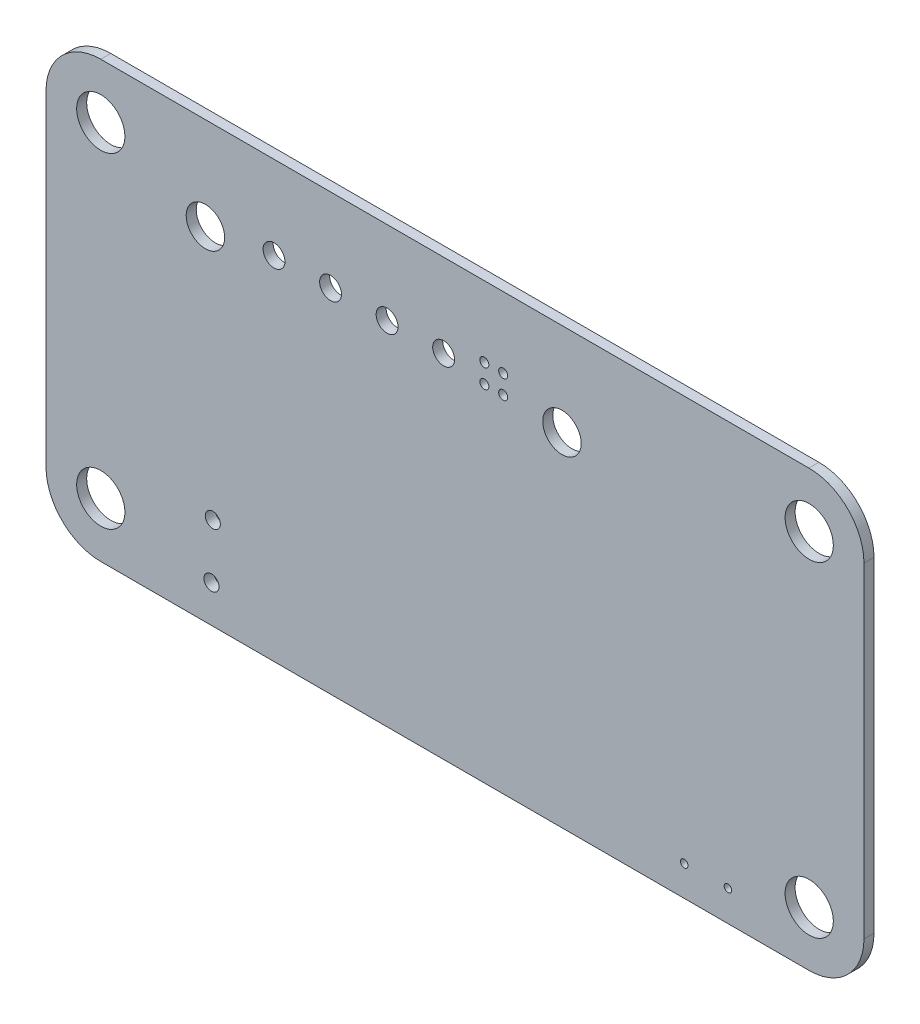
ISO-10303-21;
HEADER;
FILE_DESCRIPTION(('STEP AP214'),'2;1');
FILE_NAME('part.step','',(''),(''),'','','');
FILE_SCHEMA(('AUTOMOTIVE_DESIGN { 1 0 10303 214 1 1 1 1 }'));
ENDSEC;
DATA;
#1=APPLICATION_CONTEXT('core data for automotive mechanical design processes');
#2=APPLICATION_PROTOCOL_DEFINITION('international standard','automotive_design',2000,#1);
#3=PRODUCT_CONTEXT('',#1,'mechanical');
#4=PRODUCT('Part','Part','',(#3));
#5=PRODUCT_RELATED_PRODUCT_CATEGORY('part','',(#4));
#6=PRODUCT_DEFINITION_FORMATION('','',#4);
#7=PRODUCT_DEFINITION_CONTEXT('part definition',#1,'design');
#8=PRODUCT_DEFINITION('design','',#6,#7);
#9=PRODUCT_DEFINITION_SHAPE('','',#8);
#10=(LENGTH_UNIT() NAMED_UNIT(*) SI_UNIT(.MILLI.,.METRE.));
#11=(NAMED_UNIT(*) PLANE_ANGLE_UNIT() SI_UNIT($,.RADIAN.));
#12=(NAMED_UNIT(*) SI_UNIT($,.STERADIAN.) SOLID_ANGLE_UNIT());
#13=UNCERTAINTY_MEASURE_WITH_UNIT(LENGTH_MEASURE(1.E-05),#10,'distance_accuracy_value','');
#14=(GEOMETRIC_REPRESENTATION_CONTEXT(3) GLOBAL_UNCERTAINTY_ASSIGNED_CONTEXT((#13)) GLOBAL_UNIT_ASSIGNED_CONTEXT((#10,
#11,#12)) REPRESENTATION_CONTEXT('',''));
#15=CARTESIAN_POINT('',(0.,0.,0.));
#16=DIRECTION('',(0.,0.,1.));
#17=DIRECTION('',(1.,0.,0.));
#18=AXIS2_PLACEMENT_3D('',#15,#16,#17);
#19=CARTESIAN_POINT('',(180.808877,-103.632,-0.0262));
#20=DIRECTION('',(0.,0.,-1.));
#21=DIRECTION('',(0.,-1.,0.));
#22=AXIS2_PLACEMENT_3D('',#19,#20,#21);
#23=CYLINDRICAL_SURFACE('',#22,1.6);
#24=CARTESIAN_POINT('',(180.808877,-103.632,0.));
#25=DIRECTION('',(0.,0.,-1.));
#26=DIRECTION('',(0.,-1.,0.));
#27=AXIS2_PLACEMENT_3D('',#24,#25,#26);
#28=CIRCLE('',#27,1.6);
#29=CARTESIAN_POINT('',(180.808877,-105.232,0.));
#30=VERTEX_POINT('',#29);
#31=EDGE_CURVE('E293',#30,#30,#28,.T.);
#32=ORIENTED_EDGE('',*,*,#31,.T.);
#33=DIRECTION('',(0.,0.,1.));
#34=VECTOR('',#33,1.);
#35=CARTESIAN_POINT('',(180.808877,-105.232,-0.0262));
#36=LINE('',#35,#34);
#37=CARTESIAN_POINT('',(180.808877,-105.232,0.665));
#38=VERTEX_POINT('',#37);
#39=EDGE_CURVE('E9',#30,#38,#36,.T.);
#40=ORIENTED_EDGE('',*,*,#39,.T.);
#41=CARTESIAN_POINT('',(180.808877,-103.632,0.665));
#42=DIRECTION('',(0.,0.,-1.));
#43=DIRECTION('',(0.,-1.,0.));
#44=AXIS2_PLACEMENT_3D('',#41,#42,#43);
#45=CIRCLE('',#44,1.6);
#46=EDGE_CURVE('E257',#38,#38,#45,.T.);
#47=ORIENTED_EDGE('',*,*,#46,.F.);
#48=ORIENTED_EDGE('',*,*,#39,.F.);
#49=EDGE_LOOP('',(#32,#40,#47,#48));
#50=FACE_BOUND('',#49,.T.);
#51=ADVANCED_FACE('F15',(#50),#23,.F.);
#52=CARTESIAN_POINT('',(160.51,-104.69,-0.0262));
#53=DIRECTION('',(0.,0.,-1.));
#54=DIRECTION('',(0.,-1.,0.));
#55=AXIS2_PLACEMENT_3D('',#52,#53,#54);
#56=CYLINDRICAL_SURFACE('',#55,0.3);
#57=CARTESIAN_POINT('',(160.51,-104.69,0.));
#58=DIRECTION('',(0.,0.,-1.));
#59=DIRECTION('',(0.,-1.,0.));
#60=AXIS2_PLACEMENT_3D('',#57,#58,#59);
#61=CIRCLE('',#60,0.3);
#62=CARTESIAN_POINT('',(160.51,-104.99,0.));
#63=VERTEX_POINT('',#62);
#64=EDGE_CURVE('E290',#63,#63,#61,.T.);
#65=ORIENTED_EDGE('',*,*,#64,.T.);
#66=DIRECTION('',(0.,0.,1.));
#67=VECTOR('',#66,1.);
#68=CARTESIAN_POINT('',(160.51,-104.99,-0.0262));
#69=LINE('',#68,#67);
#70=CARTESIAN_POINT('',(160.51,-104.99,0.665));
#71=VERTEX_POINT('',#70);
#72=EDGE_CURVE('E23',#63,#71,#69,.T.);
#73=ORIENTED_EDGE('',*,*,#72,.T.);
#74=CARTESIAN_POINT('',(160.51,-104.69,0.665));
#75=DIRECTION('',(0.,0.,-1.));
#76=DIRECTION('',(0.,-1.,0.));
#77=AXIS2_PLACEMENT_3D('',#74,#75,#76);
#78=CIRCLE('',#77,0.3);
#79=EDGE_CURVE('E430',#71,#71,#78,.T.);
#80=ORIENTED_EDGE('',*,*,#79,.F.);
#81=ORIENTED_EDGE('',*,*,#72,.F.);
#82=EDGE_LOOP('',(#65,#73,#80,#81));
#83=FACE_BOUND('',#82,.T.);
#84=ADVANCED_FACE('F825',(#83),#56,.F.);
#85=CARTESIAN_POINT('',(159.26,-104.69,-0.0262));
#86=DIRECTION('',(0.,0.,-1.));
#87=DIRECTION('',(0.,-1.,0.));
#88=AXIS2_PLACEMENT_3D('',#85,#86,#87);
#89=CYLINDRICAL_SURFACE('',#88,0.3);
#90=CARTESIAN_POINT('',(159.26,-104.69,0.));
#91=DIRECTION('',(0.,0.,-1.));
#92=DIRECTION('',(0.,-1.,0.));
#93=AXIS2_PLACEMENT_3D('',#90,#91,#92);
#94=CIRCLE('',#93,0.3);
#95=CARTESIAN_POINT('',(159.26,-104.99,0.));
#96=VERTEX_POINT('',#95);
#97=EDGE_CURVE('E294',#96,#96,#94,.T.);
#98=ORIENTED_EDGE('',*,*,#97,.T.);
#99=DIRECTION('',(0.,0.,1.));
#100=VECTOR('',#99,1.);
#101=CARTESIAN_POINT('',(159.26,-104.99,-0.0262));
#102=LINE('',#101,#100);
#103=CARTESIAN_POINT('',(159.26,-104.99,0.665));
#104=VERTEX_POINT('',#103);
#105=EDGE_CURVE('E470',#96,#104,#102,.T.);
#106=ORIENTED_EDGE('',*,*,#105,.T.);
#107=CARTESIAN_POINT('',(159.26,-104.69,0.665));
#108=DIRECTION('',(0.,0.,-1.));
#109=DIRECTION('',(0.,-1.,0.));
#110=AXIS2_PLACEMENT_3D('',#107,#108,#109);
#111=CIRCLE('',#110,0.3);
#112=EDGE_CURVE('E413',#104,#104,#111,.T.);
#113=ORIENTED_EDGE('',*,*,#112,.F.);
#114=ORIENTED_EDGE('',*,*,#105,.F.);
#115=EDGE_LOOP('',(#98,#106,#113,#114));
#116=FACE_BOUND('',#115,.T.);
#117=ADVANCED_FACE('F829',(#116),#89,.F.);
#118=CARTESIAN_POINT('',(164.41,-106.14,-0.0262));
#119=DIRECTION('',(0.,0.,-1.));
#120=DIRECTION('',(0.,-1.,0.));
#121=AXIS2_PLACEMENT_3D('',#118,#119,#120);
#122=CYLINDRICAL_SURFACE('',#121,1.275);
#123=CARTESIAN_POINT('',(164.41,-106.14,0.));
#124=DIRECTION('',(0.,0.,-1.));
#125=DIRECTION('',(0.,-1.,0.));
#126=AXIS2_PLACEMENT_3D('',#123,#124,#125);
#127=CIRCLE('',#126,1.275);
#128=CARTESIAN_POINT('',(164.41,-107.415,0.));
#129=VERTEX_POINT('',#128);
#130=EDGE_CURVE('E343',#129,#129,#127,.T.);
#131=ORIENTED_EDGE('',*,*,#130,.T.);
#132=DIRECTION('',(0.,0.,1.));
#133=VECTOR('',#132,1.);
#134=CARTESIAN_POINT('',(164.41,-107.415,-0.0262));
#135=LINE('',#134,#133);
#136=CARTESIAN_POINT('',(164.41,-107.415,0.665));
#137=VERTEX_POINT('',#136);
#138=EDGE_CURVE('E467',#129,#137,#135,.T.);
#139=ORIENTED_EDGE('',*,*,#138,.T.);
#140=CARTESIAN_POINT('',(164.41,-106.14,0.665));
#141=DIRECTION('',(0.,0.,-1.));
#142=DIRECTION('',(0.,-1.,0.));
#143=AXIS2_PLACEMENT_3D('',#140,#141,#142);
#144=CIRCLE('',#143,1.275);
#145=EDGE_CURVE('E409',#137,#137,#144,.T.);
#146=ORIENTED_EDGE('',*,*,#145,.F.);
#147=ORIENTED_EDGE('',*,*,#138,.F.);
#148=EDGE_LOOP('',(#131,#139,#146,#147));
#149=FACE_BOUND('',#148,.T.);
#150=ADVANCED_FACE('F1100',(#149),#122,.F.);
#151=CARTESIAN_POINT('',(160.51,-105.94,-0.0262));
#152=DIRECTION('',(0.,0.,-1.));
#153=DIRECTION('',(0.,-1.,0.));
#154=AXIS2_PLACEMENT_3D('',#151,#152,#153);
#155=CYLINDRICAL_SURFACE('',#154,0.3);
#156=CARTESIAN_POINT('',(160.51,-105.94,0.));
#157=DIRECTION('',(0.,0.,-1.));
#158=DIRECTION('',(0.,-1.,0.));
#159=AXIS2_PLACEMENT_3D('',#156,#157,#158);
#160=CIRCLE('',#159,0.3);
#161=CARTESIAN_POINT('',(160.51,-106.24,0.));
#162=VERTEX_POINT('',#161);
#163=EDGE_CURVE('E339',#162,#162,#160,.T.);
#164=ORIENTED_EDGE('',*,*,#163,.T.);
#165=DIRECTION('',(0.,0.,1.));
#166=VECTOR('',#165,1.);
#167=CARTESIAN_POINT('',(160.51,-106.24,-0.0262));
#168=LINE('',#167,#166);
#169=CARTESIAN_POINT('',(160.51,-106.24,0.665));
#170=VERTEX_POINT('',#169);
#171=EDGE_CURVE('E471',#162,#170,#168,.T.);
#172=ORIENTED_EDGE('',*,*,#171,.T.);
#173=CARTESIAN_POINT('',(160.51,-105.94,0.665));
#174=DIRECTION('',(0.,0.,-1.));
#175=DIRECTION('',(0.,-1.,0.));
#176=AXIS2_PLACEMENT_3D('',#173,#174,#175);
#177=CIRCLE('',#176,0.3);
#178=EDGE_CURVE('E414',#170,#170,#177,.T.);
#179=ORIENTED_EDGE('',*,*,#178,.F.);
#180=ORIENTED_EDGE('',*,*,#171,.F.);
#181=EDGE_LOOP('',(#164,#172,#179,#180));
#182=FACE_BOUND('',#181,.T.);
#183=ADVANCED_FACE('F1089',(#182),#155,.F.);
#184=CARTESIAN_POINT('',(159.26,-105.94,-0.0262));
#185=DIRECTION('',(0.,0.,-1.));
#186=DIRECTION('',(0.,-1.,0.));
#187=AXIS2_PLACEMENT_3D('',#184,#185,#186);
#188=CYLINDRICAL_SURFACE('',#187,0.3);
#189=CARTESIAN_POINT('',(159.26,-105.94,0.));
#190=DIRECTION('',(0.,0.,-1.));
#191=DIRECTION('',(0.,-1.,0.));
#192=AXIS2_PLACEMENT_3D('',#189,#190,#191);
#193=CIRCLE('',#192,0.3);
#194=CARTESIAN_POINT('',(159.26,-106.24,0.));
#195=VERTEX_POINT('',#194);
#196=EDGE_CURVE('E344',#195,#195,#193,.T.);
#197=ORIENTED_EDGE('',*,*,#196,.T.);
#198=DIRECTION('',(0.,0.,1.));
#199=VECTOR('',#198,1.);
#200=CARTESIAN_POINT('',(159.26,-106.24,-0.0262));
#201=LINE('',#200,#199);
#202=CARTESIAN_POINT('',(159.26,-106.24,0.665));
#203=VERTEX_POINT('',#202);
#204=EDGE_CURVE('E448',#195,#203,#201,.T.);
#205=ORIENTED_EDGE('',*,*,#204,.T.);
#206=CARTESIAN_POINT('',(159.26,-105.94,0.665));
#207=DIRECTION('',(0.,0.,-1.));
#208=DIRECTION('',(0.,-1.,0.));
#209=AXIS2_PLACEMENT_3D('',#206,#207,#208);
#210=CIRCLE('',#209,0.3);
#211=EDGE_CURVE('E329',#203,#203,#210,.T.);
#212=ORIENTED_EDGE('',*,*,#211,.F.);
#213=ORIENTED_EDGE('',*,*,#204,.F.);
#214=EDGE_LOOP('',(#197,#205,#212,#213));
#215=FACE_BOUND('',#214,.T.);
#216=ADVANCED_FACE('F1078',(#215),#188,.F.);
#217=CARTESIAN_POINT('',(156.56,-105.52,-0.0262));
#218=DIRECTION('',(0.,0.,-1.));
#219=DIRECTION('',(0.,-1.,0.));
#220=AXIS2_PLACEMENT_3D('',#217,#218,#219);
#221=CYLINDRICAL_SURFACE('',#220,0.725);
#222=CARTESIAN_POINT('',(156.56,-105.52,0.));
#223=DIRECTION('',(0.,0.,-1.));
#224=DIRECTION('',(0.,-1.,0.));
#225=AXIS2_PLACEMENT_3D('',#222,#223,#224);
#226=CIRCLE('',#225,0.725);
#227=CARTESIAN_POINT('',(156.56,-106.245,0.));
#228=VERTEX_POINT('',#227);
#229=EDGE_CURVE('E397',#228,#228,#226,.T.);
#230=ORIENTED_EDGE('',*,*,#229,.T.);
#231=DIRECTION('',(0.,0.,1.));
#232=VECTOR('',#231,1.);
#233=CARTESIAN_POINT('',(156.56,-106.245,-0.0262));
#234=LINE('',#233,#232);
#235=CARTESIAN_POINT('',(156.56,-106.245,0.665));
#236=VERTEX_POINT('',#235);
#237=EDGE_CURVE('E358',#228,#236,#234,.T.);
#238=ORIENTED_EDGE('',*,*,#237,.T.);
#239=CARTESIAN_POINT('',(156.56,-105.52,0.665));
#240=DIRECTION('',(0.,0.,-1.));
#241=DIRECTION('',(0.,-1.,0.));
#242=AXIS2_PLACEMENT_3D('',#239,#240,#241);
#243=CIRCLE('',#242,0.725);
#244=EDGE_CURVE('E325',#236,#236,#243,.T.);
#245=ORIENTED_EDGE('',*,*,#244,.F.);
#246=ORIENTED_EDGE('',*,*,#237,.F.);
#247=EDGE_LOOP('',(#230,#238,#245,#246));
#248=FACE_BOUND('',#247,.T.);
#249=ADVANCED_FACE('F1067',(#248),#221,.F.);
#250=CARTESIAN_POINT('',(152.81,-105.52,-0.0262));
#251=DIRECTION('',(0.,0.,-1.));
#252=DIRECTION('',(0.,-1.,0.));
#253=AXIS2_PLACEMENT_3D('',#250,#251,#252);
#254=CYLINDRICAL_SURFACE('',#253,0.725);
#255=CARTESIAN_POINT('',(152.81,-105.52,0.));
#256=DIRECTION('',(0.,0.,-1.));
#257=DIRECTION('',(0.,-1.,0.));
#258=AXIS2_PLACEMENT_3D('',#255,#256,#257);
#259=CIRCLE('',#258,0.725);
#260=CARTESIAN_POINT('',(152.81,-106.245,0.));
#261=VERTEX_POINT('',#260);
#262=EDGE_CURVE('E393',#261,#261,#259,.T.);
#263=ORIENTED_EDGE('',*,*,#262,.T.);
#264=DIRECTION('',(0.,0.,1.));
#265=VECTOR('',#264,1.);
#266=CARTESIAN_POINT('',(152.81,-106.245,-0.0262));
#267=LINE('',#266,#265);
#268=CARTESIAN_POINT('',(152.81,-106.245,0.665));
#269=VERTEX_POINT('',#268);
#270=EDGE_CURVE('E355',#261,#269,#267,.T.);
#271=ORIENTED_EDGE('',*,*,#270,.T.);
#272=CARTESIAN_POINT('',(152.81,-105.52,0.665));
#273=DIRECTION('',(0.,0.,-1.));
#274=DIRECTION('',(0.,-1.,0.));
#275=AXIS2_PLACEMENT_3D('',#272,#273,#274);
#276=CIRCLE('',#275,0.725);
#277=EDGE_CURVE('E330',#269,#269,#276,.T.);
#278=ORIENTED_EDGE('',*,*,#277,.F.);
#279=ORIENTED_EDGE('',*,*,#270,.F.);
#280=EDGE_LOOP('',(#263,#271,#278,#279));
#281=FACE_BOUND('',#280,.T.);
#282=ADVANCED_FACE('F1056',(#281),#254,.F.);
#283=CARTESIAN_POINT('',(149.06,-105.52,-0.0262));
#284=DIRECTION('',(0.,0.,-1.));
#285=DIRECTION('',(0.,-1.,0.));
#286=AXIS2_PLACEMENT_3D('',#283,#284,#285);
#287=CYLINDRICAL_SURFACE('',#286,0.725);
#288=CARTESIAN_POINT('',(149.06,-105.52,0.));
#289=DIRECTION('',(0.,0.,-1.));
#290=DIRECTION('',(0.,-1.,0.));
#291=AXIS2_PLACEMENT_3D('',#288,#289,#290);
#292=CIRCLE('',#291,0.725);
#293=CARTESIAN_POINT('',(149.06,-106.245,0.));
#294=VERTEX_POINT('',#293);
#295=EDGE_CURVE('E383',#294,#294,#292,.T.);
#296=ORIENTED_EDGE('',*,*,#295,.T.);
#297=DIRECTION('',(0.,0.,1.));
#298=VECTOR('',#297,1.);
#299=CARTESIAN_POINT('',(149.06,-106.245,-0.0262));
#300=LINE('',#299,#298);
#301=CARTESIAN_POINT('',(149.06,-106.245,0.665));
#302=VERTEX_POINT('',#301);
#303=EDGE_CURVE('E359',#294,#302,#300,.T.);
#304=ORIENTED_EDGE('',*,*,#303,.T.);
#305=CARTESIAN_POINT('',(149.06,-105.52,0.665));
#306=DIRECTION('',(0.,0.,-1.));
#307=DIRECTION('',(0.,-1.,0.));
#308=AXIS2_PLACEMENT_3D('',#305,#306,#307);
#309=CIRCLE('',#308,0.725);
#310=EDGE_CURVE('E388',#302,#302,#309,.T.);
#311=ORIENTED_EDGE('',*,*,#310,.F.);
#312=ORIENTED_EDGE('',*,*,#303,.F.);
#313=EDGE_LOOP('',(#296,#304,#311,#312));
#314=FACE_BOUND('',#313,.T.);
#315=ADVANCED_FACE('F1045',(#314),#287,.F.);
#316=CARTESIAN_POINT('',(145.31,-105.52,-0.0262));
#317=DIRECTION('',(0.,0.,-1.));
#318=DIRECTION('',(0.,-1.,0.));
#319=AXIS2_PLACEMENT_3D('',#316,#317,#318);
#320=CYLINDRICAL_SURFACE('',#319,0.725);
#321=CARTESIAN_POINT('',(145.31,-105.52,0.));
#322=DIRECTION('',(0.,0.,-1.));
#323=DIRECTION('',(0.,-1.,0.));
#324=AXIS2_PLACEMENT_3D('',#321,#322,#323);
#325=CIRCLE('',#324,0.725);
#326=CARTESIAN_POINT('',(145.31,-106.245,0.));
#327=VERTEX_POINT('',#326);
#328=EDGE_CURVE('E379',#327,#327,#325,.T.);
#329=ORIENTED_EDGE('',*,*,#328,.T.);
#330=DIRECTION('',(0.,0.,1.));
#331=VECTOR('',#330,1.);
#332=CARTESIAN_POINT('',(145.31,-106.245,-0.0262));
#333=LINE('',#332,#331);
#334=CARTESIAN_POINT('',(145.31,-106.245,0.665));
#335=VERTEX_POINT('',#334);
#336=EDGE_CURVE('E488',#327,#335,#333,.T.);
#337=ORIENTED_EDGE('',*,*,#336,.T.);
#338=CARTESIAN_POINT('',(145.31,-105.52,0.665));
#339=DIRECTION('',(0.,0.,-1.));
#340=DIRECTION('',(0.,-1.,0.));
#341=AXIS2_PLACEMENT_3D('',#338,#339,#340);
#342=CIRCLE('',#341,0.725);
#343=EDGE_CURVE('E384',#335,#335,#342,.T.);
#344=ORIENTED_EDGE('',*,*,#343,.F.);
#345=ORIENTED_EDGE('',*,*,#336,.F.);
#346=EDGE_LOOP('',(#329,#337,#344,#345));
#347=FACE_BOUND('',#346,.T.);
#348=ADVANCED_FACE('F1034',(#347),#320,.F.);
#349=CARTESIAN_POINT('',(133.818877,-103.632,-0.0262));
#350=DIRECTION('',(0.,0.,-1.));
#351=DIRECTION('',(0.,-1.,0.));
#352=AXIS2_PLACEMENT_3D('',#349,#350,#351);
#353=CYLINDRICAL_SURFACE('',#352,1.6);
#354=CARTESIAN_POINT('',(133.818877,-103.632,0.));
#355=DIRECTION('',(0.,0.,-1.));
#356=DIRECTION('',(0.,-1.,0.));
#357=AXIS2_PLACEMENT_3D('',#354,#355,#356);
#358=CIRCLE('',#357,1.6);
#359=CARTESIAN_POINT('',(133.818877,-105.232,0.));
#360=VERTEX_POINT('',#359);
#361=EDGE_CURVE('E368',#360,#360,#358,.T.);
#362=ORIENTED_EDGE('',*,*,#361,.T.);
#363=DIRECTION('',(0.,0.,1.));
#364=VECTOR('',#363,1.);
#365=CARTESIAN_POINT('',(133.818877,-105.232,-0.0262));
#366=LINE('',#365,#364);
#367=CARTESIAN_POINT('',(133.818877,-105.232,0.665));
#368=VERTEX_POINT('',#367);
#369=EDGE_CURVE('E455',#360,#368,#366,.T.);
#370=ORIENTED_EDGE('',*,*,#369,.T.);
#371=CARTESIAN_POINT('',(133.818877,-103.632,0.665));
#372=DIRECTION('',(0.,0.,-1.));
#373=DIRECTION('',(0.,-1.,0.));
#374=AXIS2_PLACEMENT_3D('',#371,#372,#373);
#375=CIRCLE('',#374,1.6);
#376=EDGE_CURVE('E389',#368,#368,#375,.T.);
#377=ORIENTED_EDGE('',*,*,#376,.F.);
#378=ORIENTED_EDGE('',*,*,#369,.F.);
#379=EDGE_LOOP('',(#362,#370,#377,#378));
#380=FACE_BOUND('',#379,.T.);
#381=ADVANCED_FACE('F1023',(#380),#353,.F.);
#382=CARTESIAN_POINT('',(140.76,-106.14,-0.0262));
#383=DIRECTION('',(0.,0.,-1.));
#384=DIRECTION('',(0.,-1.,0.));
#385=AXIS2_PLACEMENT_3D('',#382,#383,#384);
#386=CYLINDRICAL_SURFACE('',#385,1.275);
#387=CARTESIAN_POINT('',(140.76,-106.14,0.));
#388=DIRECTION('',(0.,0.,-1.));
#389=DIRECTION('',(0.,-1.,0.));
#390=AXIS2_PLACEMENT_3D('',#387,#388,#389);
#391=CIRCLE('',#390,1.275);
#392=CARTESIAN_POINT('',(140.76,-107.415,0.));
#393=VERTEX_POINT('',#392);
#394=EDGE_CURVE('E364',#393,#393,#391,.T.);
#395=ORIENTED_EDGE('',*,*,#394,.T.);
#396=DIRECTION('',(0.,0.,1.));
#397=VECTOR('',#396,1.);
#398=CARTESIAN_POINT('',(140.76,-107.415,-0.0262));
#399=LINE('',#398,#397);
#400=CARTESIAN_POINT('',(140.76,-107.415,0.665));
#401=VERTEX_POINT('',#400);
#402=EDGE_CURVE('E452',#393,#401,#399,.T.);
#403=ORIENTED_EDGE('',*,*,#402,.T.);
#404=CARTESIAN_POINT('',(140.76,-106.14,0.665));
#405=DIRECTION('',(0.,0.,-1.));
#406=DIRECTION('',(0.,-1.,0.));
#407=AXIS2_PLACEMENT_3D('',#404,#405,#406);
#408=CIRCLE('',#407,1.275);
#409=EDGE_CURVE('E441',#401,#401,#408,.T.);
#410=ORIENTED_EDGE('',*,*,#409,.F.);
#411=ORIENTED_EDGE('',*,*,#402,.F.);
#412=EDGE_LOOP('',(#395,#403,#410,#411));
#413=FACE_BOUND('',#412,.T.);
#414=ADVANCED_FACE('F1012',(#413),#386,.F.);
#415=CARTESIAN_POINT('',(180.808877,-125.222,-0.0262));
#416=DIRECTION('',(0.,0.,-1.));
#417=DIRECTION('',(0.,-1.,0.));
#418=AXIS2_PLACEMENT_3D('',#415,#416,#417);
#419=CYLINDRICAL_SURFACE('',#418,1.6);
#420=CARTESIAN_POINT('',(180.808877,-125.222,0.));
#421=DIRECTION('',(0.,0.,-1.));
#422=DIRECTION('',(0.,-1.,0.));
#423=AXIS2_PLACEMENT_3D('',#420,#421,#422);
#424=CIRCLE('',#423,1.6);
#425=CARTESIAN_POINT('',(180.808877,-126.822,0.));
#426=VERTEX_POINT('',#425);
#427=EDGE_CURVE('E369',#426,#426,#424,.T.);
#428=ORIENTED_EDGE('',*,*,#427,.T.);
#429=DIRECTION('',(0.,0.,1.));
#430=VECTOR('',#429,1.);
#431=CARTESIAN_POINT('',(180.808877,-126.822,-0.0262));
#432=LINE('',#431,#430);
#433=CARTESIAN_POINT('',(180.808877,-126.822,0.665));
#434=VERTEX_POINT('',#433);
#435=EDGE_CURVE('E456',#426,#434,#432,.T.);
#436=ORIENTED_EDGE('',*,*,#435,.T.);
#437=CARTESIAN_POINT('',(180.808877,-125.222,0.665));
#438=DIRECTION('',(0.,0.,-1.));
#439=DIRECTION('',(0.,-1.,0.));
#440=AXIS2_PLACEMENT_3D('',#437,#438,#439);
#441=CIRCLE('',#440,1.6);
#442=EDGE_CURVE('E437',#434,#434,#441,.T.);
#443=ORIENTED_EDGE('',*,*,#442,.F.);
#444=ORIENTED_EDGE('',*,*,#435,.F.);
#445=EDGE_LOOP('',(#428,#436,#443,#444));
#446=FACE_BOUND('',#445,.T.);
#447=ADVANCED_FACE('F898',(#446),#419,.F.);
#448=CARTESIAN_POINT('',(175.42,-126.82,-0.0262));
#449=DIRECTION('',(0.,0.,-1.));
#450=DIRECTION('',(0.,-1.,0.));
#451=AXIS2_PLACEMENT_3D('',#448,#449,#450);
#452=CYLINDRICAL_SURFACE('',#451,0.25);
#453=CARTESIAN_POINT('',(175.42,-126.82,0.));
#454=DIRECTION('',(0.,0.,-1.));
#455=DIRECTION('',(0.,-1.,0.));
#456=AXIS2_PLACEMENT_3D('',#453,#454,#455);
#457=CIRCLE('',#456,0.25);
#458=CARTESIAN_POINT('',(175.42,-127.07,0.));
#459=VERTEX_POINT('',#458);
#460=EDGE_CURVE('E363',#459,#459,#457,.T.);
#461=ORIENTED_EDGE('',*,*,#460,.T.);
#462=DIRECTION('',(0.,0.,1.));
#463=VECTOR('',#462,1.);
#464=CARTESIAN_POINT('',(175.42,-127.07,-0.0262));
#465=LINE('',#464,#463);
#466=CARTESIAN_POINT('',(175.42,-127.07,0.665));
#467=VERTEX_POINT('',#466);
#468=EDGE_CURVE('E481',#459,#467,#465,.T.);
#469=ORIENTED_EDGE('',*,*,#468,.T.);
#470=CARTESIAN_POINT('',(175.42,-126.82,0.665));
#471=DIRECTION('',(0.,0.,-1.));
#472=DIRECTION('',(0.,-1.,0.));
#473=AXIS2_PLACEMENT_3D('',#470,#471,#472);
#474=CIRCLE('',#473,0.25);
#475=EDGE_CURVE('E442',#467,#467,#474,.T.);
#476=ORIENTED_EDGE('',*,*,#475,.F.);
#477=ORIENTED_EDGE('',*,*,#468,.F.);
#478=EDGE_LOOP('',(#461,#469,#476,#477));
#479=FACE_BOUND('',#478,.T.);
#480=ADVANCED_FACE('F889',(#479),#452,.F.);
#481=CARTESIAN_POINT('',(172.52,-126.85,-0.0262));
#482=DIRECTION('',(0.,0.,-1.));
#483=DIRECTION('',(0.,-1.,0.));
#484=AXIS2_PLACEMENT_3D('',#481,#482,#483);
#485=CYLINDRICAL_SURFACE('',#484,0.25);
#486=CARTESIAN_POINT('',(172.52,-126.85,0.));
#487=DIRECTION('',(0.,0.,-1.));
#488=DIRECTION('',(0.,-1.,0.));
#489=AXIS2_PLACEMENT_3D('',#486,#487,#488);
#490=CIRCLE('',#489,0.25);
#491=CARTESIAN_POINT('',(172.52,-127.1,0.));
#492=VERTEX_POINT('',#491);
#493=EDGE_CURVE('E354',#492,#492,#490,.T.);
#494=ORIENTED_EDGE('',*,*,#493,.T.);
#495=DIRECTION('',(0.,0.,1.));
#496=VECTOR('',#495,1.);
#497=CARTESIAN_POINT('',(172.52,-127.1,-0.0262));
#498=LINE('',#497,#496);
#499=CARTESIAN_POINT('',(172.52,-127.1,0.665));
#500=VERTEX_POINT('',#499);
#501=EDGE_CURVE('E478',#492,#500,#498,.T.);
#502=ORIENTED_EDGE('',*,*,#501,.T.);
#503=CARTESIAN_POINT('',(172.52,-126.85,0.665));
#504=DIRECTION('',(0.,0.,-1.));
#505=DIRECTION('',(0.,-1.,0.));
#506=AXIS2_PLACEMENT_3D('',#503,#504,#505);
#507=CIRCLE('',#506,0.25);
#508=EDGE_CURVE('E312',#500,#500,#507,.T.);
#509=ORIENTED_EDGE('',*,*,#508,.F.);
#510=ORIENTED_EDGE('',*,*,#501,.F.);
#511=EDGE_LOOP('',(#494,#502,#509,#510));
#512=FACE_BOUND('',#511,.T.);
#513=ADVANCED_FACE('F882',(#512),#485,.F.);
#514=CARTESIAN_POINT('',(141.25,-122.75,-0.0262));
#515=DIRECTION('',(0.,0.,-1.));
#516=DIRECTION('',(0.,-1.,0.));
#517=AXIS2_PLACEMENT_3D('',#514,#515,#516);
#518=CYLINDRICAL_SURFACE('',#517,0.5);
#519=CARTESIAN_POINT('',(141.25,-122.75,0.));
#520=DIRECTION('',(0.,0.,-1.));
#521=DIRECTION('',(0.,-1.,0.));
#522=AXIS2_PLACEMENT_3D('',#519,#520,#521);
#523=CIRCLE('',#522,0.5);
#524=CARTESIAN_POINT('',(141.25,-123.25,0.));
#525=VERTEX_POINT('',#524);
#526=EDGE_CURVE('E350',#525,#525,#523,.T.);
#527=ORIENTED_EDGE('',*,*,#526,.T.);
#528=DIRECTION('',(0.,0.,1.));
#529=VECTOR('',#528,1.);
#530=CARTESIAN_POINT('',(141.25,-123.25,-0.0262));
#531=LINE('',#530,#529);
#532=CARTESIAN_POINT('',(141.25,-123.25,0.665));
#533=VERTEX_POINT('',#532);
#534=EDGE_CURVE('E302',#525,#533,#531,.T.);
#535=ORIENTED_EDGE('',*,*,#534,.T.);
#536=CARTESIAN_POINT('',(141.25,-122.75,0.665));
#537=DIRECTION('',(0.,0.,-1.));
#538=DIRECTION('',(0.,-1.,0.));
#539=AXIS2_PLACEMENT_3D('',#536,#537,#538);
#540=CIRCLE('',#539,0.5);
#541=EDGE_CURVE('E308',#533,#533,#540,.T.);
#542=ORIENTED_EDGE('',*,*,#541,.F.);
#543=ORIENTED_EDGE('',*,*,#534,.F.);
#544=EDGE_LOOP('',(#527,#535,#542,#543));
#545=FACE_BOUND('',#544,.T.);
#546=ADVANCED_FACE('F880',(#545),#518,.F.);
#547=CARTESIAN_POINT('',(141.16,-126.39,-0.0262));
#548=DIRECTION('',(0.,0.,-1.));
#549=DIRECTION('',(0.,-1.,0.));
#550=AXIS2_PLACEMENT_3D('',#547,#548,#549);
#551=CYLINDRICAL_SURFACE('',#550,0.5);
#552=CARTESIAN_POINT('',(141.16,-126.39,0.));
#553=DIRECTION('',(0.,0.,-1.));
#554=DIRECTION('',(0.,-1.,0.));
#555=AXIS2_PLACEMENT_3D('',#552,#553,#554);
#556=CIRCLE('',#555,0.5);
#557=CARTESIAN_POINT('',(141.16,-126.89,0.));
#558=VERTEX_POINT('',#557);
#559=EDGE_CURVE('E320',#558,#558,#556,.T.);
#560=ORIENTED_EDGE('',*,*,#559,.T.);
#561=DIRECTION('',(0.,0.,1.));
#562=VECTOR('',#561,1.);
#563=CARTESIAN_POINT('',(141.16,-126.89,-0.0262));
#564=LINE('',#563,#562);
#565=CARTESIAN_POINT('',(141.16,-126.89,0.665));
#566=VERTEX_POINT('',#565);
#567=EDGE_CURVE('E299',#558,#566,#564,.T.);
#568=ORIENTED_EDGE('',*,*,#567,.T.);
#569=CARTESIAN_POINT('',(141.16,-126.39,0.665));
#570=DIRECTION('',(0.,0.,-1.));
#571=DIRECTION('',(0.,-1.,0.));
#572=AXIS2_PLACEMENT_3D('',#569,#570,#571);
#573=CIRCLE('',#572,0.5);
#574=EDGE_CURVE('E313',#566,#566,#573,.T.);
#575=ORIENTED_EDGE('',*,*,#574,.F.);
#576=ORIENTED_EDGE('',*,*,#567,.F.);
#577=EDGE_LOOP('',(#560,#568,#575,#576));
#578=FACE_BOUND('',#577,.T.);
#579=ADVANCED_FACE('F819',(#578),#551,.F.);
#580=CARTESIAN_POINT('',(133.818877,-125.222,-0.0262));
#581=DIRECTION('',(0.,0.,-1.));
#582=DIRECTION('',(0.,-1.,0.));
#583=AXIS2_PLACEMENT_3D('',#580,#581,#582);
#584=CYLINDRICAL_SURFACE('',#583,1.6);
#585=CARTESIAN_POINT('',(133.818877,-125.222,0.));
#586=DIRECTION('',(0.,0.,-1.));
#587=DIRECTION('',(0.,-1.,0.));
#588=AXIS2_PLACEMENT_3D('',#585,#586,#587);
#589=CIRCLE('',#588,1.6);
#590=CARTESIAN_POINT('',(133.818877,-126.822,0.));
#591=VERTEX_POINT('',#590);
#592=EDGE_CURVE('E267',#591,#591,#589,.T.);
#593=ORIENTED_EDGE('',*,*,#592,.T.);
#594=DIRECTION('',(0.,0.,1.));
#595=VECTOR('',#594,1.);
#596=CARTESIAN_POINT('',(133.818877,-126.822,-0.0262));
#597=LINE('',#596,#595);
#598=CARTESIAN_POINT('',(133.818877,-126.822,0.665));
#599=VERTEX_POINT('',#598);
#600=EDGE_CURVE('E303',#591,#599,#597,.T.);
#601=ORIENTED_EDGE('',*,*,#600,.T.);
#602=CARTESIAN_POINT('',(133.818877,-125.222,0.665));
#603=DIRECTION('',(0.,0.,-1.));
#604=DIRECTION('',(0.,-1.,0.));
#605=AXIS2_PLACEMENT_3D('',#602,#603,#604);
#606=CIRCLE('',#605,1.6);
#607=EDGE_CURVE('E426',#599,#599,#606,.T.);
#608=ORIENTED_EDGE('',*,*,#607,.F.);
#609=ORIENTED_EDGE('',*,*,#600,.F.);
#610=EDGE_LOOP('',(#593,#601,#608,#609));
#611=FACE_BOUND('',#610,.T.);
#612=ADVANCED_FACE('F811',(#611),#584,.F.);
#613=CARTESIAN_POINT('',(133.81887663029,-125.2220003697,0.));
#614=DIRECTION('',(0.,0.,-1.));
#615=DIRECTION('',(-4.48863254130355E-07,-0.999999999999899,0.));
#616=AXIS2_PLACEMENT_3D('',#613,#614,#615);
#617=CYLINDRICAL_SURFACE('',#616,3.632050630294);
#618=DIRECTION('',(0.,0.,1.));
#619=VECTOR('',#618,1.);
#620=CARTESIAN_POINT('',(133.818875,-128.854051,0.));
#621=LINE('',#620,#619);
#622=CARTESIAN_POINT('',(133.818875,-128.854051,0.));
#623=VERTEX_POINT('',#622);
#624=CARTESIAN_POINT('',(133.818875,-128.854051,0.665));
#625=VERTEX_POINT('',#624);
#626=EDGE_CURVE('E307',#623,#625,#621,.T.);
#627=ORIENTED_EDGE('',*,*,#626,.T.);
#628=CARTESIAN_POINT('',(133.81887663029,-125.2220003697,0.665));
#629=DIRECTION('',(0.,0.,-1.));
#630=DIRECTION('',(-4.48863254130355E-07,-0.999999999999899,0.));
#631=AXIS2_PLACEMENT_3D('',#628,#629,#630);
#632=CIRCLE('',#631,3.632050630294);
#633=CARTESIAN_POINT('',(130.186826,-125.222002,0.665));
#634=VERTEX_POINT('',#633);
#635=EDGE_CURVE('E316',#625,#634,#632,.T.);
#636=ORIENTED_EDGE('',*,*,#635,.T.);
#637=DIRECTION('',(0.,0.,1.));
#638=VECTOR('',#637,1.);
#639=CARTESIAN_POINT('',(130.186826,-125.222002,0.));
#640=LINE('',#639,#638);
#641=CARTESIAN_POINT('',(130.186826,-125.222002,0.));
#642=VERTEX_POINT('',#641);
#643=EDGE_CURVE('E304',#642,#634,#640,.T.);
#644=ORIENTED_EDGE('',*,*,#643,.F.);
#645=CARTESIAN_POINT('',(133.81887663029,-125.2220003697,0.));
#646=DIRECTION('',(0.,0.,-1.));
#647=DIRECTION('',(-4.48863254130355E-07,-0.999999999999899,0.));
#648=AXIS2_PLACEMENT_3D('',#645,#646,#647);
#649=CIRCLE('',#648,3.632050630294);
#650=EDGE_CURVE('E273',#623,#642,#649,.T.);
#651=ORIENTED_EDGE('',*,*,#650,.F.);
#652=EDGE_LOOP('',(#627,#636,#644,#651));
#653=FACE_BOUND('',#652,.T.);
#654=ADVANCED_FACE('F809',(#653),#617,.T.);
#655=CARTESIAN_POINT('',(180.808875,-128.85405,0.));
#656=DIRECTION('',(2.12811235896E-08,-1.,0.));
#657=DIRECTION('',(0.,0.,-1.));
#658=AXIS2_PLACEMENT_3D('',#655,#656,#657);
#659=PLANE('',#658);
#660=DIRECTION('',(0.,0.,1.));
#661=VECTOR('',#660,1.);
#662=CARTESIAN_POINT('',(180.808875,-128.85405,0.));
#663=LINE('',#662,#661);
#664=CARTESIAN_POINT('',(180.808875,-128.85405,0.));
#665=VERTEX_POINT('',#664);
#666=CARTESIAN_POINT('',(180.808875,-128.85405,0.665));
#667=VERTEX_POINT('',#666);
#668=EDGE_CURVE('E256',#665,#667,#663,.T.);
#669=ORIENTED_EDGE('',*,*,#668,.T.);
#670=DIRECTION('',(-1.,-2.12811235896E-08,0.));
#671=VECTOR('',#670,1.);
#672=CARTESIAN_POINT('',(180.808875,-128.85405,0.665));
#673=LINE('',#672,#671);
#674=EDGE_CURVE('E331',#667,#625,#673,.T.);
#675=ORIENTED_EDGE('',*,*,#674,.T.);
#676=ORIENTED_EDGE('',*,*,#626,.F.);
#677=DIRECTION('',(-1.,-2.12811235896E-08,0.));
#678=VECTOR('',#677,1.);
#679=CARTESIAN_POINT('',(180.808875,-128.85405,0.));
#680=LINE('',#679,#678);
#681=EDGE_CURVE('E279',#665,#623,#680,.T.);
#682=ORIENTED_EDGE('',*,*,#681,.F.);
#683=EDGE_LOOP('',(#669,#675,#676,#682));
#684=FACE_BOUND('',#683,.T.);
#685=ADVANCED_FACE('F806',(#684),#659,.T.);
#686=CARTESIAN_POINT('',(130.186826,-125.222002,0.));
#687=DIRECTION('',(-1.,9.26354705733896E-08,0.));
#688=DIRECTION('',(0.,0.,1.));
#689=AXIS2_PLACEMENT_3D('',#686,#687,#688);
#690=PLANE('',#689);
#691=ORIENTED_EDGE('',*,*,#643,.T.);
#692=DIRECTION('',(9.26354705733896E-08,1.,0.));
#693=VECTOR('',#692,1.);
#694=CARTESIAN_POINT('',(130.186826,-125.222002,0.665));
#695=LINE('',#694,#693);
#696=CARTESIAN_POINT('',(130.186828,-103.632,0.665));
#697=VERTEX_POINT('',#696);
#698=EDGE_CURVE('E252',#634,#697,#695,.T.);
#699=ORIENTED_EDGE('',*,*,#698,.T.);
#700=DIRECTION('',(0.,0.,1.));
#701=VECTOR('',#700,1.);
#702=CARTESIAN_POINT('',(130.186828,-103.632,0.));
#703=LINE('',#702,#701);
#704=CARTESIAN_POINT('',(130.186828,-103.632,0.));
#705=VERTEX_POINT('',#704);
#706=EDGE_CURVE('E245',#705,#697,#703,.T.);
#707=ORIENTED_EDGE('',*,*,#706,.F.);
#708=DIRECTION('',(9.26354705733896E-08,1.,0.));
#709=VECTOR('',#708,1.);
#710=CARTESIAN_POINT('',(130.186826,-125.222002,0.));
#711=LINE('',#710,#709);
#712=EDGE_CURVE('E249',#642,#705,#711,.T.);
#713=ORIENTED_EDGE('',*,*,#712,.F.);
#714=EDGE_LOOP('',(#691,#699,#707,#713));
#715=FACE_BOUND('',#714,.T.);
#716=ADVANCED_FACE('F247',(#715),#690,.T.);
#717=CARTESIAN_POINT('',(180.80887907681,-125.2220010768,0.));
#718=DIRECTION('',(0.,0.,-1.));
#719=DIRECTION('',(0.999999999999968,-2.54178313050592E-07,0.));
#720=AXIS2_PLACEMENT_3D('',#717,#718,#719);
#721=CYLINDRICAL_SURFACE('',#720,3.63204892319);
#722=DIRECTION('',(0.,0.,1.));
#723=VECTOR('',#722,1.);
#724=CARTESIAN_POINT('',(184.440928,-125.222002,0.));
#725=LINE('',#724,#723);
#726=CARTESIAN_POINT('',(184.440928,-125.222002,0.));
#727=VERTEX_POINT('',#726);
#728=CARTESIAN_POINT('',(184.440928,-125.222002,0.665));
#729=VERTEX_POINT('',#728);
#730=EDGE_CURVE('E289',#727,#729,#725,.T.);
#731=ORIENTED_EDGE('',*,*,#730,.T.);
#732=CARTESIAN_POINT('',(180.80887907681,-125.2220010768,0.665));
#733=DIRECTION('',(0.,0.,-1.));
#734=DIRECTION('',(0.999999999999968,-2.54178313050592E-07,0.));
#735=AXIS2_PLACEMENT_3D('',#732,#733,#734);
#736=CIRCLE('',#735,3.63204892319);
#737=EDGE_CURVE('E335',#729,#667,#736,.T.);
#738=ORIENTED_EDGE('',*,*,#737,.T.);
#739=ORIENTED_EDGE('',*,*,#668,.F.);
#740=CARTESIAN_POINT('',(180.80887907681,-125.2220010768,0.));
#741=DIRECTION('',(0.,0.,-1.));
#742=DIRECTION('',(0.999999999999968,-2.54178313050592E-07,0.));
#743=AXIS2_PLACEMENT_3D('',#740,#741,#742);
#744=CIRCLE('',#743,3.63204892319);
#745=EDGE_CURVE('E324',#727,#665,#744,.T.);
#746=ORIENTED_EDGE('',*,*,#745,.F.);
#747=EDGE_LOOP('',(#731,#738,#739,#746));
#748=FACE_BOUND('',#747,.T.);
#749=ADVANCED_FACE('F804',(#748),#721,.T.);
#750=CARTESIAN_POINT('',(133.81887863029,-103.6320016302,0.));
#751=DIRECTION('',(0.,0.,-1.));
#752=DIRECTION('',(-0.999999999999899,4.48863261955555E-07,0.));
#753=AXIS2_PLACEMENT_3D('',#750,#751,#752);
#754=CYLINDRICAL_SURFACE('',#753,3.632050630294);
#755=ORIENTED_EDGE('',*,*,#706,.T.);
#756=CARTESIAN_POINT('',(133.81887863029,-103.6320016302,0.665));
#757=DIRECTION('',(0.,0.,-1.));
#758=DIRECTION('',(-0.999999999999899,4.48863261955555E-07,0.));
#759=AXIS2_PLACEMENT_3D('',#756,#757,#758);
#760=CIRCLE('',#759,3.632050630294);
#761=CARTESIAN_POINT('',(133.818877,-99.999951,0.665));
#762=VERTEX_POINT('',#761);
#763=EDGE_CURVE('E317',#697,#762,#760,.T.);
#764=ORIENTED_EDGE('',*,*,#763,.T.);
#765=DIRECTION('',(0.,0.,1.));
#766=VECTOR('',#765,1.);
#767=CARTESIAN_POINT('',(133.818877,-99.999951,0.));
#768=LINE('',#767,#766);
#769=CARTESIAN_POINT('',(133.818877,-99.999951,0.));
#770=VERTEX_POINT('',#769);
#771=EDGE_CURVE('E263',#770,#762,#768,.T.);
#772=ORIENTED_EDGE('',*,*,#771,.F.);
#773=CARTESIAN_POINT('',(133.81887863029,-103.6320016302,0.));
#774=DIRECTION('',(0.,0.,-1.));
#775=DIRECTION('',(-0.999999999999899,4.48863261955555E-07,0.));
#776=AXIS2_PLACEMENT_3D('',#773,#774,#775);
#777=CIRCLE('',#776,3.632050630294);
#778=EDGE_CURVE('E260',#705,#770,#777,.T.);
#779=ORIENTED_EDGE('',*,*,#778,.F.);
#780=EDGE_LOOP('',(#755,#764,#772,#779));
#781=FACE_BOUND('',#780,.T.);
#782=ADVANCED_FACE('F261',(#781),#754,.T.);
#783=CARTESIAN_POINT('',(0.,0.,0.665));
#784=DIRECTION('',(0.,0.,1.));
#785=DIRECTION('',(1.,0.,0.));
#786=AXIS2_PLACEMENT_3D('',#783,#784,#785);
#787=PLANE('',#786);
#788=ORIENTED_EDGE('',*,*,#46,.T.);
#789=EDGE_LOOP('',(#788));
#790=FACE_BOUND('',#789,.T.);
#791=ORIENTED_EDGE('',*,*,#79,.T.);
#792=EDGE_LOOP('',(#791));
#793=FACE_BOUND('',#792,.T.);
#794=ORIENTED_EDGE('',*,*,#112,.T.);
#795=EDGE_LOOP('',(#794));
#796=FACE_BOUND('',#795,.T.);
#797=ORIENTED_EDGE('',*,*,#145,.T.);
#798=EDGE_LOOP('',(#797));
#799=FACE_BOUND('',#798,.T.);
#800=ORIENTED_EDGE('',*,*,#178,.T.);
#801=EDGE_LOOP('',(#800));
#802=FACE_BOUND('',#801,.T.);
#803=ORIENTED_EDGE('',*,*,#211,.T.);
#804=EDGE_LOOP('',(#803));
#805=FACE_BOUND('',#804,.T.);
#806=ORIENTED_EDGE('',*,*,#244,.T.);
#807=EDGE_LOOP('',(#806));
#808=FACE_BOUND('',#807,.T.);
#809=ORIENTED_EDGE('',*,*,#277,.T.);
#810=EDGE_LOOP('',(#809));
#811=FACE_BOUND('',#810,.T.);
#812=ORIENTED_EDGE('',*,*,#310,.T.);
#813=EDGE_LOOP('',(#812));
#814=FACE_BOUND('',#813,.T.);
#815=ORIENTED_EDGE('',*,*,#343,.T.);
#816=EDGE_LOOP('',(#815));
#817=FACE_BOUND('',#816,.T.);
#818=ORIENTED_EDGE('',*,*,#376,.T.);
#819=EDGE_LOOP('',(#818));
#820=FACE_BOUND('',#819,.T.);
#821=ORIENTED_EDGE('',*,*,#409,.T.);
#822=EDGE_LOOP('',(#821));
#823=FACE_BOUND('',#822,.T.);
#824=ORIENTED_EDGE('',*,*,#442,.T.);
#825=EDGE_LOOP('',(#824));
#826=FACE_BOUND('',#825,.T.);
#827=ORIENTED_EDGE('',*,*,#475,.T.);
#828=EDGE_LOOP('',(#827));
#829=FACE_BOUND('',#828,.T.);
#830=ORIENTED_EDGE('',*,*,#508,.T.);
#831=EDGE_LOOP('',(#830));
#832=FACE_BOUND('',#831,.T.);
#833=ORIENTED_EDGE('',*,*,#541,.T.);
#834=EDGE_LOOP('',(#833));
#835=FACE_BOUND('',#834,.T.);
#836=ORIENTED_EDGE('',*,*,#574,.T.);
#837=EDGE_LOOP('',(#836));
#838=FACE_BOUND('',#837,.T.);
#839=ORIENTED_EDGE('',*,*,#607,.T.);
#840=EDGE_LOOP('',(#839));
#841=FACE_BOUND('',#840,.T.);
#842=CARTESIAN_POINT('',(180.80886160339,-103.6320371151,0.665));
#843=DIRECTION('',(0.,0.,-1.));
#844=DIRECTION('',(-0.00515615297662742,0.999986706954888,0.));
#845=AXIS2_PLACEMENT_3D('',#842,#843,#844);
#846=CIRCLE('',#845,3.632088396689);
#847=CARTESIAN_POINT('',(180.790134,-99.999997,0.665));
#848=VERTEX_POINT('',#847);
#849=CARTESIAN_POINT('',(184.44095,-103.632012,0.665));
#850=VERTEX_POINT('',#849);
#851=EDGE_CURVE('E768',#848,#850,#846,.T.);
#852=ORIENTED_EDGE('',*,*,#851,.F.);
#853=DIRECTION('',(0.999999999999521,-9.7932231188753E-07,0.));
#854=VECTOR('',#853,1.);
#855=CARTESIAN_POINT('',(133.818877,-99.999951,0.665));
#856=LINE('',#855,#854);
#857=EDGE_CURVE('E740',#762,#848,#856,.T.);
#858=ORIENTED_EDGE('',*,*,#857,.F.);
#859=ORIENTED_EDGE('',*,*,#763,.F.);
#860=ORIENTED_EDGE('',*,*,#698,.F.);
#861=ORIENTED_EDGE('',*,*,#635,.F.);
#862=ORIENTED_EDGE('',*,*,#674,.F.);
#863=ORIENTED_EDGE('',*,*,#737,.F.);
#864=DIRECTION('',(-1.01899074399149E-06,-0.999999999999481,0.));
#865=VECTOR('',#864,1.);
#866=CARTESIAN_POINT('',(184.44095,-103.632012,0.665));
#867=LINE('',#866,#865);
#868=EDGE_CURVE('E285',#850,#729,#867,.T.);
#869=ORIENTED_EDGE('',*,*,#868,.F.);
#870=EDGE_LOOP('',(#852,#858,#859,#860,#861,#862,#863,#869));
#871=FACE_BOUND('',#870,.T.);
#872=ADVANCED_FACE('F797',(#790,#793,#796,#799,#802,#805,#808,#811,#814,#817,#820,#823,#826,
#829,#832,#835,#838,#841,#871),#787,.T.);
#873=CARTESIAN_POINT('',(0.,0.,0.));
#874=DIRECTION('',(0.,0.,1.));
#875=DIRECTION('',(1.,0.,0.));
#876=AXIS2_PLACEMENT_3D('',#873,#874,#875);
#877=PLANE('',#876);
#878=ORIENTED_EDGE('',*,*,#31,.F.);
#879=EDGE_LOOP('',(#878));
#880=FACE_BOUND('',#879,.T.);
#881=ORIENTED_EDGE('',*,*,#64,.F.);
#882=EDGE_LOOP('',(#881));
#883=FACE_BOUND('',#882,.T.);
#884=ORIENTED_EDGE('',*,*,#97,.F.);
#885=EDGE_LOOP('',(#884));
#886=FACE_BOUND('',#885,.T.);
#887=ORIENTED_EDGE('',*,*,#130,.F.);
#888=EDGE_LOOP('',(#887));
#889=FACE_BOUND('',#888,.T.);
#890=ORIENTED_EDGE('',*,*,#163,.F.);
#891=EDGE_LOOP('',(#890));
#892=FACE_BOUND('',#891,.T.);
#893=ORIENTED_EDGE('',*,*,#196,.F.);
#894=EDGE_LOOP('',(#893));
#895=FACE_BOUND('',#894,.T.);
#896=ORIENTED_EDGE('',*,*,#229,.F.);
#897=EDGE_LOOP('',(#896));
#898=FACE_BOUND('',#897,.T.);
#899=ORIENTED_EDGE('',*,*,#262,.F.);
#900=EDGE_LOOP('',(#899));
#901=FACE_BOUND('',#900,.T.);
#902=ORIENTED_EDGE('',*,*,#295,.F.);
#903=EDGE_LOOP('',(#902));
#904=FACE_BOUND('',#903,.T.);
#905=ORIENTED_EDGE('',*,*,#328,.F.);
#906=EDGE_LOOP('',(#905));
#907=FACE_BOUND('',#906,.T.);
#908=ORIENTED_EDGE('',*,*,#361,.F.);
#909=EDGE_LOOP('',(#908));
#910=FACE_BOUND('',#909,.T.);
#911=ORIENTED_EDGE('',*,*,#394,.F.);
#912=EDGE_LOOP('',(#911));
#913=FACE_BOUND('',#912,.T.);
#914=ORIENTED_EDGE('',*,*,#427,.F.);
#915=EDGE_LOOP('',(#914));
#916=FACE_BOUND('',#915,.T.);
#917=ORIENTED_EDGE('',*,*,#460,.F.);
#918=EDGE_LOOP('',(#917));
#919=FACE_BOUND('',#918,.T.);
#920=ORIENTED_EDGE('',*,*,#493,.F.);
#921=EDGE_LOOP('',(#920));
#922=FACE_BOUND('',#921,.T.);
#923=ORIENTED_EDGE('',*,*,#526,.F.);
#924=EDGE_LOOP('',(#923));
#925=FACE_BOUND('',#924,.T.);
#926=ORIENTED_EDGE('',*,*,#559,.F.);
#927=EDGE_LOOP('',(#926));
#928=FACE_BOUND('',#927,.T.);
#929=ORIENTED_EDGE('',*,*,#592,.F.);
#930=EDGE_LOOP('',(#929));
#931=FACE_BOUND('',#930,.T.);
#932=DIRECTION('',(-1.01899074399149E-06,-0.999999999999481,0.));
#933=VECTOR('',#932,1.);
#934=CARTESIAN_POINT('',(184.44095,-103.632012,0.));
#935=LINE('',#934,#933);
#936=CARTESIAN_POINT('',(184.44095,-103.632012,0.));
#937=VERTEX_POINT('',#936);
#938=EDGE_CURVE('E298',#937,#727,#935,.T.);
#939=ORIENTED_EDGE('',*,*,#938,.T.);
#940=ORIENTED_EDGE('',*,*,#745,.T.);
#941=ORIENTED_EDGE('',*,*,#681,.T.);
#942=ORIENTED_EDGE('',*,*,#650,.T.);
#943=ORIENTED_EDGE('',*,*,#712,.T.);
#944=ORIENTED_EDGE('',*,*,#778,.T.);
#945=DIRECTION('',(0.999999999999521,-9.7932231188753E-07,0.));
#946=VECTOR('',#945,1.);
#947=CARTESIAN_POINT('',(133.818877,-99.999951,0.));
#948=LINE('',#947,#946);
#949=CARTESIAN_POINT('',(180.790134,-99.999997,0.));
#950=VERTEX_POINT('',#949);
#951=EDGE_CURVE('E283',#770,#950,#948,.T.);
#952=ORIENTED_EDGE('',*,*,#951,.T.);
#953=CARTESIAN_POINT('',(180.80886160339,-103.6320371151,0.));
#954=DIRECTION('',(0.,0.,-1.));
#955=DIRECTION('',(-0.00515615297662742,0.999986706954888,0.));
#956=AXIS2_PLACEMENT_3D('',#953,#954,#955);
#957=CIRCLE('',#956,3.632088396689);
#958=EDGE_CURVE('E752',#950,#937,#957,.T.);
#959=ORIENTED_EDGE('',*,*,#958,.T.);
#960=EDGE_LOOP('',(#939,#940,#941,#942,#943,#944,#952,#959));
#961=FACE_BOUND('',#960,.T.);
#962=ADVANCED_FACE('F270',(#880,#883,#886,#889,#892,#895,#898,#901,#904,#907,#910,#913,#916,
#919,#922,#925,#928,#931,#961),#877,.F.);
#963=CARTESIAN_POINT('',(184.44095,-103.632012,0.));
#964=DIRECTION('',(0.999999999999481,-1.01899074399149E-06,0.));
#965=DIRECTION('',(0.,0.,-1.));
#966=AXIS2_PLACEMENT_3D('',#963,#964,#965);
#967=PLANE('',#966);
#968=DIRECTION('',(0.,0.,1.));
#969=VECTOR('',#968,1.);
#970=CARTESIAN_POINT('',(184.44095,-103.632012,0.));
#971=LINE('',#970,#969);
#972=EDGE_CURVE('E759',#937,#850,#971,.T.);
#973=ORIENTED_EDGE('',*,*,#972,.T.);
#974=ORIENTED_EDGE('',*,*,#868,.T.);
#975=ORIENTED_EDGE('',*,*,#730,.F.);
#976=ORIENTED_EDGE('',*,*,#938,.F.);
#977=EDGE_LOOP('',(#973,#974,#975,#976));
#978=FACE_BOUND('',#977,.T.);
#979=ADVANCED_FACE('F801',(#978),#967,.T.);
#980=CARTESIAN_POINT('',(133.818877,-99.999951,0.));
#981=DIRECTION('',(9.7932231188753E-07,0.999999999999521,0.));
#982=DIRECTION('',(0.,0.,-1.));
#983=AXIS2_PLACEMENT_3D('',#980,#981,#982);
#984=PLANE('',#983);
#985=ORIENTED_EDGE('',*,*,#771,.T.);
#986=ORIENTED_EDGE('',*,*,#857,.T.);
#987=DIRECTION('',(0.,0.,1.));
#988=VECTOR('',#987,1.);
#989=CARTESIAN_POINT('',(180.790134,-99.999997,0.));
#990=LINE('',#989,#988);
#991=EDGE_CURVE('E775',#950,#848,#990,.T.);
#992=ORIENTED_EDGE('',*,*,#991,.F.);
#993=ORIENTED_EDGE('',*,*,#951,.F.);
#994=EDGE_LOOP('',(#985,#986,#992,#993));
#995=FACE_BOUND('',#994,.T.);
#996=ADVANCED_FACE('F794',(#995),#984,.T.);
#997=CARTESIAN_POINT('',(180.80886160339,-103.6320371151,0.));
#998=DIRECTION('',(0.,0.,-1.));
#999=DIRECTION('',(-0.00515615297662742,0.999986706954888,0.));
#1000=AXIS2_PLACEMENT_3D('',#997,#998,#999);
#1001=CYLINDRICAL_SURFACE('',#1000,3.632088396689);
#1002=ORIENTED_EDGE('',*,*,#991,.T.);
#1003=ORIENTED_EDGE('',*,*,#851,.T.);
#1004=ORIENTED_EDGE('',*,*,#972,.F.);
#1005=ORIENTED_EDGE('',*,*,#958,.F.);
#1006=EDGE_LOOP('',(#1002,#1003,#1004,#1005));
#1007=FACE_BOUND('',#1006,.T.);
#1008=ADVANCED_FACE('F790',(#1007),#1001,.T.);
#1009=CLOSED_SHELL('',(#51,#84,#117,#150,#183,#216,#249,#282,#315,#348,#381,#414,#447,#480,#513,
#546,#579,#612,#654,#685,#716,#749,#782,#872,#962,#979,#996,#1008));
#1010=MANIFOLD_SOLID_BREP('B1',#1009);
#1011=ADVANCED_BREP_SHAPE_REPRESENTATION('',(#18,#1010),#14);
#1012=SHAPE_DEFINITION_REPRESENTATION(#9,#1011);
ENDSEC;
END-ISO-10303-21;
